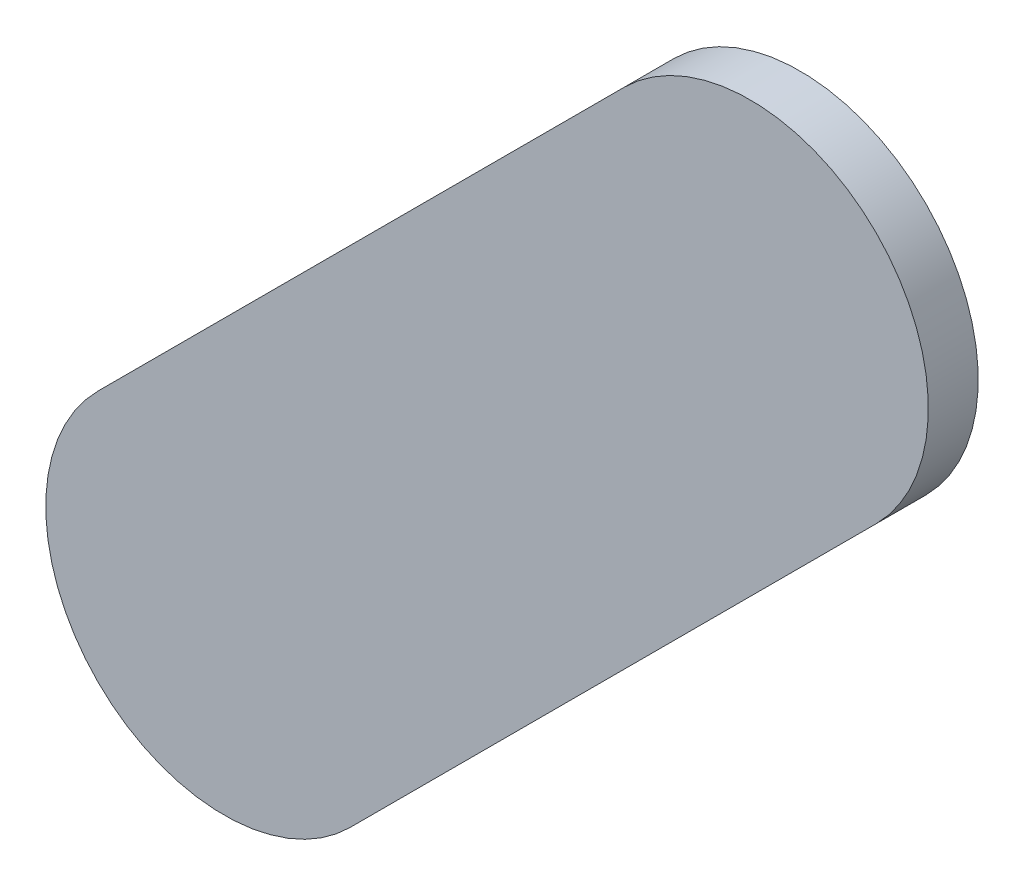
ISO-10303-21;
HEADER;
FILE_DESCRIPTION(('STEP AP214'),'2;1');
FILE_NAME('part.step','',(''),(''),'','','');
FILE_SCHEMA(('AUTOMOTIVE_DESIGN { 1 0 10303 214 1 1 1 1 }'));
ENDSEC;
DATA;
#1=APPLICATION_CONTEXT('core data for automotive mechanical design processes');
#2=APPLICATION_PROTOCOL_DEFINITION('international standard','automotive_design',2000,#1);
#3=PRODUCT_CONTEXT('',#1,'mechanical');
#4=PRODUCT('Part','Part','',(#3));
#5=PRODUCT_RELATED_PRODUCT_CATEGORY('part','',(#4));
#6=PRODUCT_DEFINITION_FORMATION('','',#4);
#7=PRODUCT_DEFINITION_CONTEXT('part definition',#1,'design');
#8=PRODUCT_DEFINITION('design','',#6,#7);
#9=PRODUCT_DEFINITION_SHAPE('','',#8);
#10=(LENGTH_UNIT() NAMED_UNIT(*) SI_UNIT(.MILLI.,.METRE.));
#11=(NAMED_UNIT(*) PLANE_ANGLE_UNIT() SI_UNIT($,.RADIAN.));
#12=(NAMED_UNIT(*) SI_UNIT($,.STERADIAN.) SOLID_ANGLE_UNIT());
#13=UNCERTAINTY_MEASURE_WITH_UNIT(LENGTH_MEASURE(1.E-05),#10,'distance_accuracy_value','');
#14=(GEOMETRIC_REPRESENTATION_CONTEXT(3) GLOBAL_UNCERTAINTY_ASSIGNED_CONTEXT((#13)) GLOBAL_UNIT_ASSIGNED_CONTEXT((#10,
#11,#12)) REPRESENTATION_CONTEXT('',''));
#15=CARTESIAN_POINT('',(0.,0.,0.));
#16=DIRECTION('',(0.,0.,1.));
#17=DIRECTION('',(1.,0.,0.));
#18=AXIS2_PLACEMENT_3D('',#15,#16,#17);
#19=CARTESIAN_POINT('',(90.50677606,72.19717082,0.));
#20=DIRECTION('',(-0.707109175776271,0.707104386588715,0.));
#21=DIRECTION('',(0.707104386588715,0.707109175776271,0.));
#22=AXIS2_PLACEMENT_3D('',#19,#20,#21);
#23=PLANE('',#22);
#24=DIRECTION('',(0.707104386588715,0.70710917577627,0.));
#25=VECTOR('',#24,1.);
#26=CARTESIAN_POINT('',(90.50677606,72.19717082,0.03556));
#27=LINE('',#26,#25);
#28=CARTESIAN_POINT('',(90.50677606,72.19717082,0.03556));
#29=VERTEX_POINT('',#28);
#30=CARTESIAN_POINT('',(90.8817969,72.5721942,0.03556));
#31=VERTEX_POINT('',#30);
#32=EDGE_CURVE('E11',#29,#31,#27,.T.);
#33=ORIENTED_EDGE('',*,*,#32,.F.);
#34=DIRECTION('',(0.,0.,1.));
#35=VECTOR('',#34,1.);
#36=CARTESIAN_POINT('',(90.50677606,72.19717082,0.));
#37=LINE('',#36,#35);
#38=CARTESIAN_POINT('',(90.50677606,72.19717082,0.));
#39=VERTEX_POINT('',#38);
#40=EDGE_CURVE('E24',#39,#29,#37,.T.);
#41=ORIENTED_EDGE('',*,*,#40,.F.);
#42=DIRECTION('',(0.707104386588715,0.70710917577627,0.));
#43=VECTOR('',#42,1.);
#44=CARTESIAN_POINT('',(90.50677606,72.19717082,0.));
#45=LINE('',#44,#43);
#46=CARTESIAN_POINT('',(90.8817969,72.5721942,0.));
#47=VERTEX_POINT('',#46);
#48=EDGE_CURVE('E75',#39,#47,#45,.T.);
#49=ORIENTED_EDGE('',*,*,#48,.T.);
#50=DIRECTION('',(0.,0.,1.));
#51=VECTOR('',#50,1.);
#52=CARTESIAN_POINT('',(90.8817969,72.5721942,0.));
#53=LINE('',#52,#51);
#54=EDGE_CURVE('E37',#47,#31,#53,.T.);
#55=ORIENTED_EDGE('',*,*,#54,.T.);
#56=EDGE_LOOP('',(#33,#41,#49,#55));
#57=FACE_BOUND('',#56,.T.);
#58=ADVANCED_FACE('F17',(#57),#23,.F.);
#59=CARTESIAN_POINT('',(90.7919952,72.6619959,0.));
#60=DIRECTION('',(0.,0.,-1.));
#61=DIRECTION('',(0.707106781186548,-0.707106781186548,0.));
#62=AXIS2_PLACEMENT_3D('',#59,#60,#61);
#63=CYLINDRICAL_SURFACE('',#62,0.126998782064163);
#64=CARTESIAN_POINT('',(90.7919952,72.6619959,0.03556));
#65=DIRECTION('',(0.,0.,1.));
#66=DIRECTION('',(0.707106781186548,-0.707106781186548,0.));
#67=AXIS2_PLACEMENT_3D('',#64,#65,#66);
#68=CIRCLE('',#67,0.126998782064163);
#69=CARTESIAN_POINT('',(90.7021935,72.7517976,0.03556));
#70=VERTEX_POINT('',#69);
#71=EDGE_CURVE('E83',#31,#70,#68,.T.);
#72=ORIENTED_EDGE('',*,*,#71,.F.);
#73=ORIENTED_EDGE('',*,*,#54,.F.);
#74=CARTESIAN_POINT('',(90.7919952,72.6619959,0.));
#75=DIRECTION('',(0.,0.,1.));
#76=DIRECTION('',(0.707106781186548,-0.707106781186548,0.));
#77=AXIS2_PLACEMENT_3D('',#74,#75,#76);
#78=CIRCLE('',#77,0.126998782064163);
#79=CARTESIAN_POINT('',(90.7021935,72.7517976,0.));
#80=VERTEX_POINT('',#79);
#81=EDGE_CURVE('E81',#47,#80,#78,.T.);
#82=ORIENTED_EDGE('',*,*,#81,.T.);
#83=DIRECTION('',(0.,0.,1.));
#84=VECTOR('',#83,1.);
#85=CARTESIAN_POINT('',(90.7021935,72.7517976,0.));
#86=LINE('',#85,#84);
#87=EDGE_CURVE('E67',#80,#70,#86,.T.);
#88=ORIENTED_EDGE('',*,*,#87,.T.);
#89=EDGE_LOOP('',(#72,#73,#82,#88));
#90=FACE_BOUND('',#89,.T.);
#91=ADVANCED_FACE('F89',(#90),#63,.T.);
#92=CARTESIAN_POINT('',(90.7021935,72.7517976,0.));
#93=DIRECTION('',(0.707104386588729,-0.707109175776257,0.));
#94=DIRECTION('',(-0.707109175776257,-0.707104386588729,0.));
#95=AXIS2_PLACEMENT_3D('',#92,#93,#94);
#96=PLANE('',#95);
#97=DIRECTION('',(-0.707109175776257,-0.707104386588729,0.));
#98=VECTOR('',#97,1.);
#99=CARTESIAN_POINT('',(90.7021935,72.7517976,0.03556));
#100=LINE('',#99,#98);
#101=CARTESIAN_POINT('',(90.32717012,72.37677676,0.03556));
#102=VERTEX_POINT('',#101);
#103=EDGE_CURVE('E71',#70,#102,#100,.T.);
#104=ORIENTED_EDGE('',*,*,#103,.F.);
#105=ORIENTED_EDGE('',*,*,#87,.F.);
#106=DIRECTION('',(-0.707109175776257,-0.707104386588729,0.));
#107=VECTOR('',#106,1.);
#108=CARTESIAN_POINT('',(90.7021935,72.7517976,0.));
#109=LINE('',#108,#107);
#110=CARTESIAN_POINT('',(90.32717012,72.37677676,0.));
#111=VERTEX_POINT('',#110);
#112=EDGE_CURVE('E63',#80,#111,#109,.T.);
#113=ORIENTED_EDGE('',*,*,#112,.T.);
#114=DIRECTION('',(0.,0.,1.));
#115=VECTOR('',#114,1.);
#116=CARTESIAN_POINT('',(90.32717012,72.37677676,0.));
#117=LINE('',#116,#115);
#118=EDGE_CURVE('E53',#111,#102,#117,.T.);
#119=ORIENTED_EDGE('',*,*,#118,.T.);
#120=EDGE_LOOP('',(#104,#105,#113,#119));
#121=FACE_BOUND('',#120,.T.);
#122=ADVANCED_FACE('F66',(#121),#96,.F.);
#123=CARTESIAN_POINT('',(90.41697309,72.28697379,0.));
#124=DIRECTION('',(0.,0.,-1.));
#125=DIRECTION('',(-0.707106781186492,0.707106781186604,0.));
#126=AXIS2_PLACEMENT_3D('',#123,#124,#125);
#127=CYLINDRICAL_SURFACE('',#126,0.127000578115379);
#128=CARTESIAN_POINT('',(90.41697309,72.28697379,0.03556));
#129=DIRECTION('',(0.,0.,1.));
#130=DIRECTION('',(-0.707106781186492,0.707106781186604,0.));
#131=AXIS2_PLACEMENT_3D('',#128,#129,#130);
#132=CIRCLE('',#131,0.127000578115379);
#133=EDGE_CURVE('E59',#102,#29,#132,.T.);
#134=ORIENTED_EDGE('',*,*,#133,.F.);
#135=ORIENTED_EDGE('',*,*,#118,.F.);
#136=CARTESIAN_POINT('',(90.41697309,72.28697379,0.));
#137=DIRECTION('',(0.,0.,1.));
#138=DIRECTION('',(-0.707106781186492,0.707106781186604,0.));
#139=AXIS2_PLACEMENT_3D('',#136,#137,#138);
#140=CIRCLE('',#139,0.127000578115379);
#141=EDGE_CURVE('E57',#111,#39,#140,.T.);
#142=ORIENTED_EDGE('',*,*,#141,.T.);
#143=ORIENTED_EDGE('',*,*,#40,.T.);
#144=EDGE_LOOP('',(#134,#135,#142,#143));
#145=FACE_BOUND('',#144,.T.);
#146=ADVANCED_FACE('F55',(#145),#127,.T.);
#147=CARTESIAN_POINT('',(90.50677606,72.19717082,0.));
#148=DIRECTION('',(0.,0.,-1.));
#149=DIRECTION('',(-1.,0.,0.));
#150=AXIS2_PLACEMENT_3D('',#147,#148,#149);
#151=PLANE('',#150);
#152=ORIENTED_EDGE('',*,*,#141,.F.);
#153=ORIENTED_EDGE('',*,*,#112,.F.);
#154=ORIENTED_EDGE('',*,*,#81,.F.);
#155=ORIENTED_EDGE('',*,*,#48,.F.);
#156=EDGE_LOOP('',(#152,#153,#154,#155));
#157=FACE_BOUND('',#156,.T.);
#158=ADVANCED_FACE('F74',(#157),#151,.T.);
#159=CARTESIAN_POINT('',(90.50677606,72.19717082,0.03556));
#160=DIRECTION('',(0.,0.,-1.));
#161=DIRECTION('',(-1.,0.,0.));
#162=AXIS2_PLACEMENT_3D('',#159,#160,#161);
#163=PLANE('',#162);
#164=ORIENTED_EDGE('',*,*,#32,.T.);
#165=ORIENTED_EDGE('',*,*,#71,.T.);
#166=ORIENTED_EDGE('',*,*,#103,.T.);
#167=ORIENTED_EDGE('',*,*,#133,.T.);
#168=EDGE_LOOP('',(#164,#165,#166,#167));
#169=FACE_BOUND('',#168,.T.);
#170=ADVANCED_FACE('F91',(#169),#163,.F.);
#171=CLOSED_SHELL('',(#58,#91,#122,#146,#158,#170));
#172=MANIFOLD_SOLID_BREP('B1',#171);
#173=ADVANCED_BREP_SHAPE_REPRESENTATION('',(#18,#172),#14);
#174=SHAPE_DEFINITION_REPRESENTATION(#9,#173);
ENDSEC;
END-ISO-10303-21;
